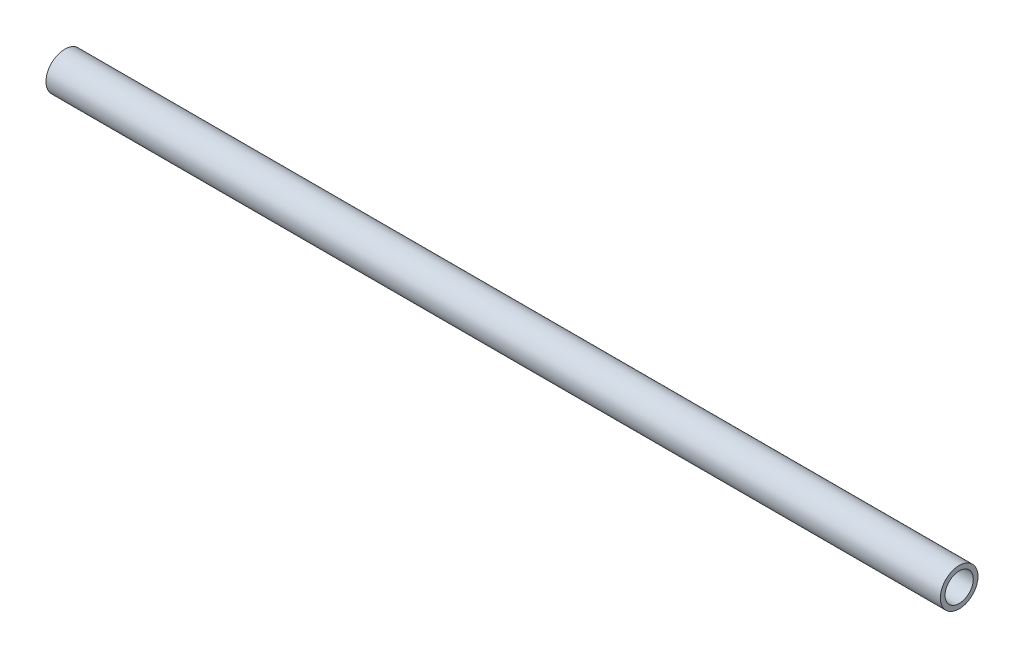
ISO-10303-21;
HEADER;
FILE_DESCRIPTION(('STEP AP214'),'2;1');
FILE_NAME('part.step','',(''),(''),'','','');
FILE_SCHEMA(('AUTOMOTIVE_DESIGN { 1 0 10303 214 1 1 1 1 }'));
ENDSEC;
DATA;
#1=APPLICATION_CONTEXT('core data for automotive mechanical design processes');
#2=APPLICATION_PROTOCOL_DEFINITION('international standard','automotive_design',2000,#1);
#3=PRODUCT_CONTEXT('',#1,'mechanical');
#4=PRODUCT('Part','Part','',(#3));
#5=PRODUCT_RELATED_PRODUCT_CATEGORY('part','',(#4));
#6=PRODUCT_DEFINITION_FORMATION('','',#4);
#7=PRODUCT_DEFINITION_CONTEXT('part definition',#1,'design');
#8=PRODUCT_DEFINITION('design','',#6,#7);
#9=PRODUCT_DEFINITION_SHAPE('','',#8);
#10=(LENGTH_UNIT() NAMED_UNIT(*) SI_UNIT(.MILLI.,.METRE.));
#11=(NAMED_UNIT(*) PLANE_ANGLE_UNIT() SI_UNIT($,.RADIAN.));
#12=(NAMED_UNIT(*) SI_UNIT($,.STERADIAN.) SOLID_ANGLE_UNIT());
#13=UNCERTAINTY_MEASURE_WITH_UNIT(LENGTH_MEASURE(1.E-05),#10,'distance_accuracy_value','');
#14=(GEOMETRIC_REPRESENTATION_CONTEXT(3) GLOBAL_UNCERTAINTY_ASSIGNED_CONTEXT((#13)) GLOBAL_UNIT_ASSIGNED_CONTEXT((#10,
#11,#12)) REPRESENTATION_CONTEXT('',''));
#15=CARTESIAN_POINT('',(0.,0.,0.));
#16=DIRECTION('',(0.,0.,1.));
#17=DIRECTION('',(1.,0.,0.));
#18=AXIS2_PLACEMENT_3D('',#15,#16,#17);
#19=CARTESIAN_POINT('',(95.,0.,0.));
#20=DIRECTION('',(1.,0.,0.));
#21=DIRECTION('',(0.,0.,-1.));
#22=AXIS2_PLACEMENT_3D('',#19,#20,#21);
#23=PLANE('',#22);
#24=CARTESIAN_POINT('',(95.,0.,0.));
#25=DIRECTION('',(1.,0.,0.));
#26=DIRECTION('',(0.,0.,-1.));
#27=AXIS2_PLACEMENT_3D('',#24,#25,#26);
#28=CIRCLE('',#27,4.);
#29=CARTESIAN_POINT('',(95.,0.,-4.));
#30=VERTEX_POINT('',#29);
#31=EDGE_CURVE('E10',#30,#30,#28,.T.);
#32=ORIENTED_EDGE('',*,*,#31,.T.);
#33=EDGE_LOOP('',(#32));
#34=FACE_BOUND('',#33,.T.);
#35=CARTESIAN_POINT('',(95.,0.,0.));
#36=DIRECTION('',(1.,0.,0.));
#37=DIRECTION('',(0.,0.,-1.));
#38=AXIS2_PLACEMENT_3D('',#35,#36,#37);
#39=CIRCLE('',#38,3.);
#40=CARTESIAN_POINT('',(95.,0.,-3.));
#41=VERTEX_POINT('',#40);
#42=EDGE_CURVE('E44',#41,#41,#39,.T.);
#43=ORIENTED_EDGE('',*,*,#42,.F.);
#44=EDGE_LOOP('',(#43));
#45=FACE_BOUND('',#44,.T.);
#46=ADVANCED_FACE('F33',(#34,#45),#23,.T.);
#47=CARTESIAN_POINT('',(-95.,0.,0.));
#48=DIRECTION('',(1.,0.,0.));
#49=DIRECTION('',(0.,0.,-1.));
#50=AXIS2_PLACEMENT_3D('',#47,#48,#49);
#51=PLANE('',#50);
#52=CARTESIAN_POINT('',(-95.,0.,0.));
#53=DIRECTION('',(1.,0.,0.));
#54=DIRECTION('',(0.,0.,-1.));
#55=AXIS2_PLACEMENT_3D('',#52,#53,#54);
#56=CIRCLE('',#55,4.);
#57=CARTESIAN_POINT('',(-95.,0.,-4.));
#58=VERTEX_POINT('',#57);
#59=EDGE_CURVE('E37',#58,#58,#56,.T.);
#60=ORIENTED_EDGE('',*,*,#59,.F.);
#61=EDGE_LOOP('',(#60));
#62=FACE_BOUND('',#61,.T.);
#63=CARTESIAN_POINT('',(-95.,0.,0.));
#64=DIRECTION('',(1.,0.,0.));
#65=DIRECTION('',(0.,0.,-1.));
#66=AXIS2_PLACEMENT_3D('',#63,#64,#65);
#67=CIRCLE('',#66,3.);
#68=CARTESIAN_POINT('',(-95.,0.,-3.));
#69=VERTEX_POINT('',#68);
#70=EDGE_CURVE('E46',#69,#69,#67,.T.);
#71=ORIENTED_EDGE('',*,*,#70,.T.);
#72=EDGE_LOOP('',(#71));
#73=FACE_BOUND('',#72,.T.);
#74=ADVANCED_FACE('F56',(#62,#73),#51,.F.);
#75=CARTESIAN_POINT('',(95.,0.,0.));
#76=DIRECTION('',(-1.,0.,0.));
#77=DIRECTION('',(0.,0.,1.));
#78=AXIS2_PLACEMENT_3D('',#75,#76,#77);
#79=CYLINDRICAL_SURFACE('',#78,4.);
#80=ORIENTED_EDGE('',*,*,#31,.F.);
#81=EDGE_LOOP('',(#80));
#82=FACE_BOUND('',#81,.T.);
#83=ORIENTED_EDGE('',*,*,#59,.T.);
#84=EDGE_LOOP('',(#83));
#85=FACE_BOUND('',#84,.T.);
#86=ADVANCED_FACE('F35',(#82,#85),#79,.T.);
#87=CARTESIAN_POINT('',(95.,0.,0.));
#88=DIRECTION('',(-1.,0.,0.));
#89=DIRECTION('',(0.,0.,1.));
#90=AXIS2_PLACEMENT_3D('',#87,#88,#89);
#91=CYLINDRICAL_SURFACE('',#90,3.);
#92=ORIENTED_EDGE('',*,*,#42,.T.);
#93=EDGE_LOOP('',(#92));
#94=FACE_BOUND('',#93,.T.);
#95=ORIENTED_EDGE('',*,*,#70,.F.);
#96=EDGE_LOOP('',(#95));
#97=FACE_BOUND('',#96,.T.);
#98=ADVANCED_FACE('F52',(#94,#97),#91,.F.);
#99=CLOSED_SHELL('',(#46,#74,#86,#98));
#100=MANIFOLD_SOLID_BREP('B2',#99);
#101=ADVANCED_BREP_SHAPE_REPRESENTATION('',(#18,#100),#14);
#102=SHAPE_DEFINITION_REPRESENTATION(#9,#101);
ENDSEC;
END-ISO-10303-21;
